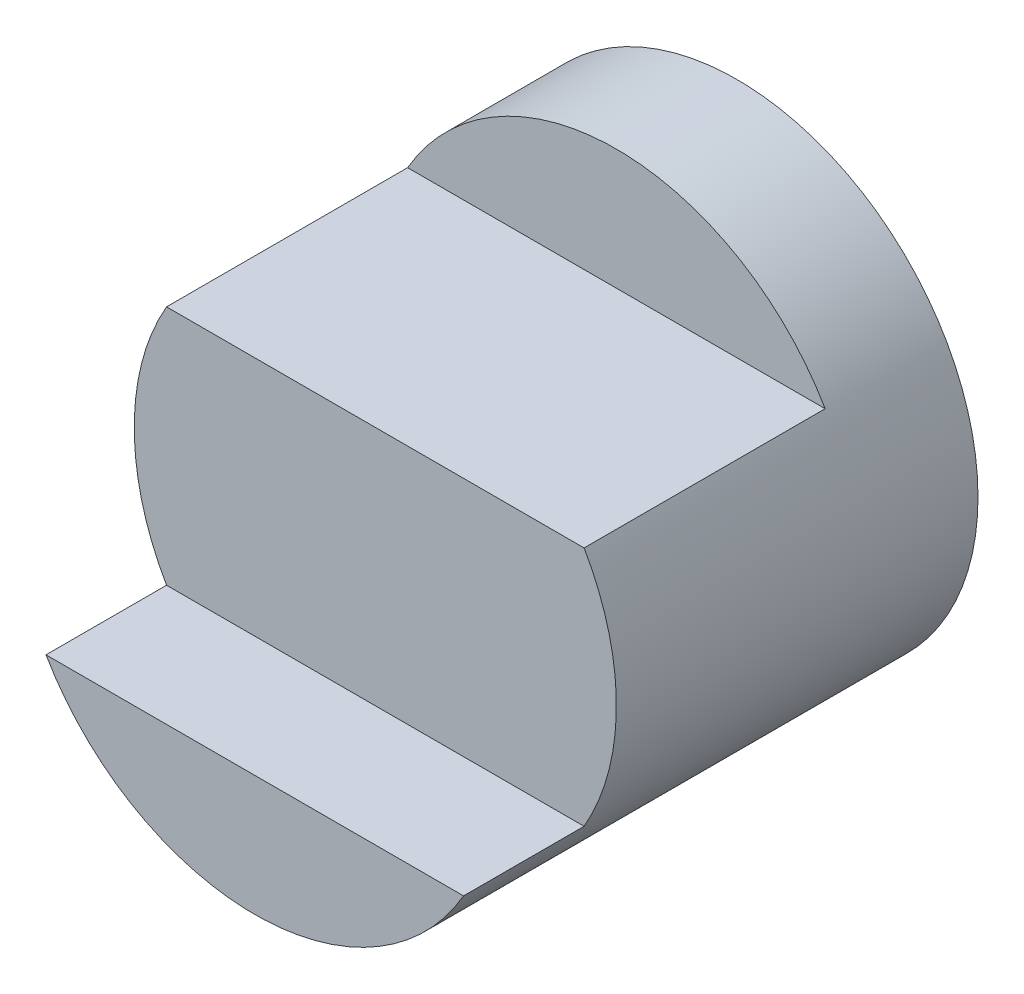
ISO-10303-21;
HEADER;
FILE_DESCRIPTION(('STEP AP214'),'2;1');
FILE_NAME('part.step','',(''),(''),'','','');
FILE_SCHEMA(('AUTOMOTIVE_DESIGN { 1 0 10303 214 1 1 1 1 }'));
ENDSEC;
DATA;
#1=APPLICATION_CONTEXT('core data for automotive mechanical design processes');
#2=APPLICATION_PROTOCOL_DEFINITION('international standard','automotive_design',2000,#1);
#3=PRODUCT_CONTEXT('',#1,'mechanical');
#4=PRODUCT('Part','Part','',(#3));
#5=PRODUCT_RELATED_PRODUCT_CATEGORY('part','',(#4));
#6=PRODUCT_DEFINITION_FORMATION('','',#4);
#7=PRODUCT_DEFINITION_CONTEXT('part definition',#1,'design');
#8=PRODUCT_DEFINITION('design','',#6,#7);
#9=PRODUCT_DEFINITION_SHAPE('','',#8);
#10=(LENGTH_UNIT() NAMED_UNIT(*) SI_UNIT(.MILLI.,.METRE.));
#11=(NAMED_UNIT(*) PLANE_ANGLE_UNIT() SI_UNIT($,.RADIAN.));
#12=(NAMED_UNIT(*) SI_UNIT($,.STERADIAN.) SOLID_ANGLE_UNIT());
#13=UNCERTAINTY_MEASURE_WITH_UNIT(LENGTH_MEASURE(1.E-05),#10,'distance_accuracy_value','');
#14=(GEOMETRIC_REPRESENTATION_CONTEXT(3) GLOBAL_UNCERTAINTY_ASSIGNED_CONTEXT((#13)) GLOBAL_UNIT_ASSIGNED_CONTEXT((#10,
#11,#12)) REPRESENTATION_CONTEXT('',''));
#15=CARTESIAN_POINT('',(0.,0.,0.));
#16=DIRECTION('',(0.,0.,1.));
#17=DIRECTION('',(1.,0.,0.));
#18=AXIS2_PLACEMENT_3D('',#15,#16,#17);
#19=CARTESIAN_POINT('',(0.,0.,4.));
#20=DIRECTION('',(0.,0.,-1.));
#21=DIRECTION('',(-1.,0.,0.));
#22=AXIS2_PLACEMENT_3D('',#19,#20,#21);
#23=CYLINDRICAL_SURFACE('',#22,2.);
#24=DIRECTION('',(0.,0.,-1.));
#25=VECTOR('',#24,1.);
#26=CARTESIAN_POINT('',(-1.73205080756888,-1.,4.));
#27=LINE('',#26,#25);
#28=CARTESIAN_POINT('',(-1.73205080756888,-1.,4.));
#29=VERTEX_POINT('',#28);
#30=CARTESIAN_POINT('',(-1.73205080756888,-1.,3.));
#31=VERTEX_POINT('',#30);
#32=EDGE_CURVE('E84',#29,#31,#27,.T.);
#33=ORIENTED_EDGE('',*,*,#32,.T.);
#34=CARTESIAN_POINT('',(0.,0.,3.));
#35=DIRECTION('',(0.,0.,-1.));
#36=DIRECTION('',(-1.,0.,0.));
#37=AXIS2_PLACEMENT_3D('',#34,#35,#36);
#38=CIRCLE('',#37,2.);
#39=CARTESIAN_POINT('',(-1.73205080756888,1.,3.));
#40=VERTEX_POINT('',#39);
#41=EDGE_CURVE('E72',#31,#40,#38,.T.);
#42=ORIENTED_EDGE('',*,*,#41,.T.);
#43=DIRECTION('',(0.,0.,1.));
#44=VECTOR('',#43,1.);
#45=CARTESIAN_POINT('',(-1.73205080756888,1.,1.));
#46=LINE('',#45,#44);
#47=CARTESIAN_POINT('',(-1.73205080756888,1.,1.));
#48=VERTEX_POINT('',#47);
#49=EDGE_CURVE('E101',#48,#40,#46,.T.);
#50=ORIENTED_EDGE('',*,*,#49,.F.);
#51=CARTESIAN_POINT('',(0.,0.,1.));
#52=DIRECTION('',(0.,0.,1.));
#53=DIRECTION('',(-1.,0.,0.));
#54=AXIS2_PLACEMENT_3D('',#51,#52,#53);
#55=CIRCLE('',#54,2.);
#56=CARTESIAN_POINT('',(1.73205080756888,1.,1.));
#57=VERTEX_POINT('',#56);
#58=EDGE_CURVE('E93',#57,#48,#55,.T.);
#59=ORIENTED_EDGE('',*,*,#58,.F.);
#60=DIRECTION('',(0.,0.,1.));
#61=VECTOR('',#60,1.);
#62=CARTESIAN_POINT('',(1.73205080756888,1.,1.));
#63=LINE('',#62,#61);
#64=CARTESIAN_POINT('',(1.73205080756888,1.,3.));
#65=VERTEX_POINT('',#64);
#66=EDGE_CURVE('E53',#57,#65,#63,.T.);
#67=ORIENTED_EDGE('',*,*,#66,.T.);
#68=CARTESIAN_POINT('',(1.73205080756888,-1.,3.));
#69=VERTEX_POINT('',#68);
#70=EDGE_CURVE('E47',#65,#69,#38,.T.);
#71=ORIENTED_EDGE('',*,*,#70,.T.);
#72=DIRECTION('',(0.,0.,-1.));
#73=VECTOR('',#72,1.);
#74=CARTESIAN_POINT('',(1.73205080756888,-1.,4.));
#75=LINE('',#74,#73);
#76=CARTESIAN_POINT('',(1.73205080756888,-1.,4.));
#77=VERTEX_POINT('',#76);
#78=EDGE_CURVE('E87',#69,#77,#75,.F.);
#79=ORIENTED_EDGE('',*,*,#78,.T.);
#80=CARTESIAN_POINT('',(0.,0.,4.));
#81=DIRECTION('',(0.,0.,-1.));
#82=DIRECTION('',(-1.,0.,0.));
#83=AXIS2_PLACEMENT_3D('',#80,#81,#82);
#84=CIRCLE('',#83,2.);
#85=EDGE_CURVE('E92',#77,#29,#84,.T.);
#86=ORIENTED_EDGE('',*,*,#85,.T.);
#87=EDGE_LOOP('',(#33,#42,#50,#59,#67,#71,#79,#86));
#88=FACE_BOUND('',#87,.T.);
#89=CARTESIAN_POINT('',(0.,0.,0.));
#90=DIRECTION('',(0.,0.,1.));
#91=DIRECTION('',(1.,0.,0.));
#92=AXIS2_PLACEMENT_3D('',#89,#90,#91);
#93=CIRCLE('',#92,2.);
#94=CARTESIAN_POINT('',(2.,0.,0.));
#95=VERTEX_POINT('',#94);
#96=EDGE_CURVE('E40',#95,#95,#93,.T.);
#97=ORIENTED_EDGE('',*,*,#96,.T.);
#98=EDGE_LOOP('',(#97));
#99=FACE_BOUND('',#98,.T.);
#100=ADVANCED_FACE('F33',(#88,#99),#23,.T.);
#101=CARTESIAN_POINT('',(0.,0.,0.));
#102=DIRECTION('',(0.,0.,1.));
#103=DIRECTION('',(1.,0.,0.));
#104=AXIS2_PLACEMENT_3D('',#101,#102,#103);
#105=PLANE('',#104);
#106=ORIENTED_EDGE('',*,*,#96,.F.);
#107=EDGE_LOOP('',(#106));
#108=FACE_BOUND('',#107,.T.);
#109=ADVANCED_FACE('F106',(#108),#105,.F.);
#110=CARTESIAN_POINT('',(-1.73205080756888,1.,1.));
#111=DIRECTION('',(0.,-1.,0.));
#112=DIRECTION('',(0.,0.,-1.));
#113=AXIS2_PLACEMENT_3D('',#110,#111,#112);
#114=PLANE('',#113);
#115=ORIENTED_EDGE('',*,*,#49,.T.);
#116=DIRECTION('',(1.,0.,0.));
#117=VECTOR('',#116,1.);
#118=CARTESIAN_POINT('',(-1.73205080756888,1.,3.));
#119=LINE('',#118,#117);
#120=EDGE_CURVE('E11',#40,#65,#119,.T.);
#121=ORIENTED_EDGE('',*,*,#120,.T.);
#122=ORIENTED_EDGE('',*,*,#66,.F.);
#123=DIRECTION('',(1.,0.,0.));
#124=VECTOR('',#123,1.);
#125=CARTESIAN_POINT('',(-1.73205080756888,1.,1.));
#126=LINE('',#125,#124);
#127=EDGE_CURVE('E95',#48,#57,#126,.T.);
#128=ORIENTED_EDGE('',*,*,#127,.F.);
#129=EDGE_LOOP('',(#115,#121,#122,#128));
#130=FACE_BOUND('',#129,.T.);
#131=ADVANCED_FACE('F108',(#130),#114,.F.);
#132=CARTESIAN_POINT('',(0.,0.,1.));
#133=DIRECTION('',(0.,0.,-1.));
#134=DIRECTION('',(-1.,0.,0.));
#135=AXIS2_PLACEMENT_3D('',#132,#133,#134);
#136=PLANE('',#135);
#137=ORIENTED_EDGE('',*,*,#58,.T.);
#138=ORIENTED_EDGE('',*,*,#127,.T.);
#139=EDGE_LOOP('',(#137,#138));
#140=FACE_BOUND('',#139,.T.);
#141=ADVANCED_FACE('F113',(#140),#136,.F.);
#142=CARTESIAN_POINT('',(-6.,-1.,4.));
#143=DIRECTION('',(0.,-1.,0.));
#144=DIRECTION('',(0.,0.,-1.));
#145=AXIS2_PLACEMENT_3D('',#142,#143,#144);
#146=PLANE('',#145);
#147=DIRECTION('',(1.,0.,0.));
#148=VECTOR('',#147,1.);
#149=CARTESIAN_POINT('',(-6.,-1.,4.));
#150=LINE('',#149,#148);
#151=EDGE_CURVE('E88',#29,#77,#150,.T.);
#152=ORIENTED_EDGE('',*,*,#151,.T.);
#153=ORIENTED_EDGE('',*,*,#78,.F.);
#154=DIRECTION('',(1.,0.,0.));
#155=VECTOR('',#154,1.);
#156=CARTESIAN_POINT('',(-6.,-1.,3.));
#157=LINE('',#156,#155);
#158=EDGE_CURVE('E75',#31,#69,#157,.T.);
#159=ORIENTED_EDGE('',*,*,#158,.F.);
#160=ORIENTED_EDGE('',*,*,#32,.F.);
#161=EDGE_LOOP('',(#152,#153,#159,#160));
#162=FACE_BOUND('',#161,.T.);
#163=ADVANCED_FACE('F83',(#162),#146,.F.);
#164=CARTESIAN_POINT('',(-6.,-2.24475738045981,4.));
#165=DIRECTION('',(0.,0.,-1.));
#166=DIRECTION('',(-1.,0.,0.));
#167=AXIS2_PLACEMENT_3D('',#164,#165,#166);
#168=PLANE('',#167);
#169=ORIENTED_EDGE('',*,*,#151,.F.);
#170=ORIENTED_EDGE('',*,*,#85,.F.);
#171=EDGE_LOOP('',(#169,#170));
#172=FACE_BOUND('',#171,.T.);
#173=ADVANCED_FACE('F119',(#172),#168,.F.);
#174=CARTESIAN_POINT('',(-6.,1.,3.));
#175=DIRECTION('',(0.,0.,-1.));
#176=DIRECTION('',(-1.,0.,0.));
#177=AXIS2_PLACEMENT_3D('',#174,#175,#176);
#178=PLANE('',#177);
#179=ORIENTED_EDGE('',*,*,#120,.F.);
#180=ORIENTED_EDGE('',*,*,#41,.F.);
#181=ORIENTED_EDGE('',*,*,#158,.T.);
#182=ORIENTED_EDGE('',*,*,#70,.F.);
#183=EDGE_LOOP('',(#179,#180,#181,#182));
#184=FACE_BOUND('',#183,.T.);
#185=ADVANCED_FACE('F74',(#184),#178,.F.);
#186=CLOSED_SHELL('',(#100,#109,#131,#141,#163,#173,#185));
#187=MANIFOLD_SOLID_BREP('B2',#186);
#188=ADVANCED_BREP_SHAPE_REPRESENTATION('',(#18,#187),#14);
#189=SHAPE_DEFINITION_REPRESENTATION(#9,#188);
ENDSEC;
END-ISO-10303-21;
